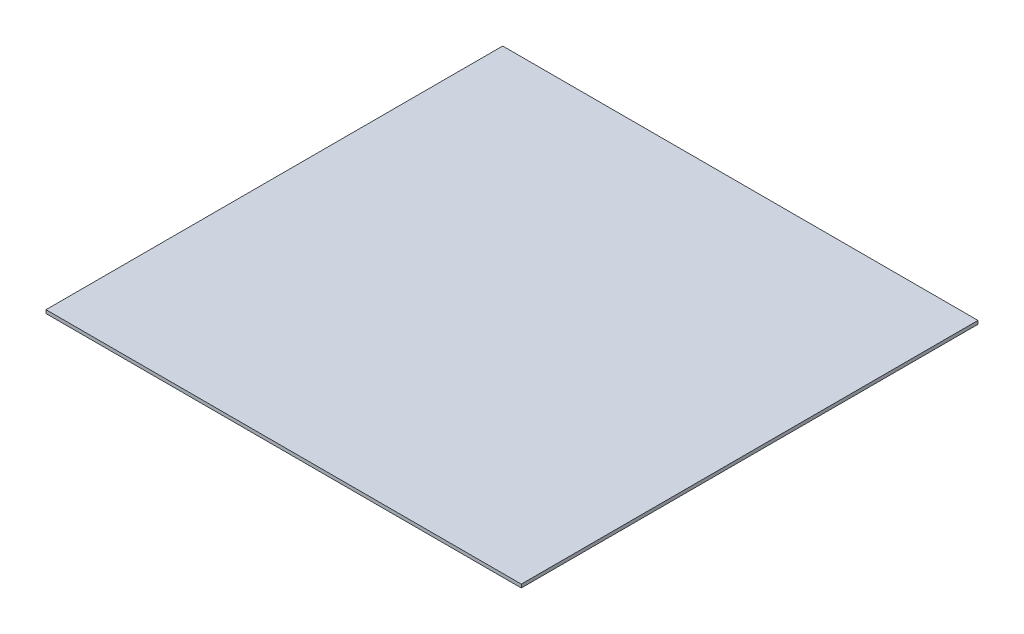
ISO-10303-21;
HEADER;
FILE_DESCRIPTION(('STEP AP214'),'2;1');
FILE_NAME('part.step','',(''),(''),'','','');
FILE_SCHEMA(('AUTOMOTIVE_DESIGN { 1 0 10303 214 1 1 1 1 }'));
ENDSEC;
DATA;
#1=APPLICATION_CONTEXT('core data for automotive mechanical design processes');
#2=APPLICATION_PROTOCOL_DEFINITION('international standard','automotive_design',2000,#1);
#3=PRODUCT_CONTEXT('',#1,'mechanical');
#4=PRODUCT('Part','Part','',(#3));
#5=PRODUCT_RELATED_PRODUCT_CATEGORY('part','',(#4));
#6=PRODUCT_DEFINITION_FORMATION('','',#4);
#7=PRODUCT_DEFINITION_CONTEXT('part definition',#1,'design');
#8=PRODUCT_DEFINITION('design','',#6,#7);
#9=PRODUCT_DEFINITION_SHAPE('','',#8);
#10=(LENGTH_UNIT() NAMED_UNIT(*) SI_UNIT(.MILLI.,.METRE.));
#11=(NAMED_UNIT(*) PLANE_ANGLE_UNIT() SI_UNIT($,.RADIAN.));
#12=(NAMED_UNIT(*) SI_UNIT($,.STERADIAN.) SOLID_ANGLE_UNIT());
#13=UNCERTAINTY_MEASURE_WITH_UNIT(LENGTH_MEASURE(1.E-05),#10,'distance_accuracy_value','');
#14=(GEOMETRIC_REPRESENTATION_CONTEXT(3) GLOBAL_UNCERTAINTY_ASSIGNED_CONTEXT((#13)) GLOBAL_UNIT_ASSIGNED_CONTEXT((#10,
#11,#12)) REPRESENTATION_CONTEXT('',''));
#15=CARTESIAN_POINT('',(0.,0.,0.));
#16=DIRECTION('',(0.,0.,1.));
#17=DIRECTION('',(1.,0.,0.));
#18=AXIS2_PLACEMENT_3D('',#15,#16,#17);
#19=CARTESIAN_POINT('',(281.,4.,-270.));
#20=DIRECTION('',(-1.,0.,0.));
#21=DIRECTION('',(0.,0.,1.));
#22=AXIS2_PLACEMENT_3D('',#19,#20,#21);
#23=PLANE('',#22);
#24=DIRECTION('',(0.,0.,-1.));
#25=VECTOR('',#24,1.);
#26=CARTESIAN_POINT('',(281.,0.,-270.));
#27=LINE('',#26,#25);
#28=CARTESIAN_POINT('',(281.,0.,270.));
#29=VERTEX_POINT('',#28);
#30=CARTESIAN_POINT('',(281.,0.,-270.));
#31=VERTEX_POINT('',#30);
#32=EDGE_CURVE('E97',#29,#31,#27,.T.);
#33=ORIENTED_EDGE('',*,*,#32,.T.);
#34=DIRECTION('',(0.,-1.,0.));
#35=VECTOR('',#34,1.);
#36=CARTESIAN_POINT('',(281.,4.,-270.));
#37=LINE('',#36,#35);
#38=CARTESIAN_POINT('',(281.,4.,-270.));
#39=VERTEX_POINT('',#38);
#40=EDGE_CURVE('E11',#39,#31,#37,.T.);
#41=ORIENTED_EDGE('',*,*,#40,.F.);
#42=DIRECTION('',(0.,0.,-1.));
#43=VECTOR('',#42,1.);
#44=CARTESIAN_POINT('',(281.,4.,-270.));
#45=LINE('',#44,#43);
#46=CARTESIAN_POINT('',(281.,4.,270.));
#47=VERTEX_POINT('',#46);
#48=EDGE_CURVE('E85',#47,#39,#45,.T.);
#49=ORIENTED_EDGE('',*,*,#48,.F.);
#50=DIRECTION('',(0.,-1.,0.));
#51=VECTOR('',#50,1.);
#52=CARTESIAN_POINT('',(281.,4.,270.));
#53=LINE('',#52,#51);
#54=EDGE_CURVE('E93',#47,#29,#53,.T.);
#55=ORIENTED_EDGE('',*,*,#54,.T.);
#56=EDGE_LOOP('',(#33,#41,#49,#55));
#57=FACE_BOUND('',#56,.T.);
#58=ADVANCED_FACE('F34',(#57),#23,.F.);
#59=CARTESIAN_POINT('',(-281.,4.,-270.));
#60=DIRECTION('',(0.,0.,1.));
#61=DIRECTION('',(1.,0.,0.));
#62=AXIS2_PLACEMENT_3D('',#59,#60,#61);
#63=PLANE('',#62);
#64=DIRECTION('',(-1.,0.,0.));
#65=VECTOR('',#64,1.);
#66=CARTESIAN_POINT('',(-281.,0.,-270.));
#67=LINE('',#66,#65);
#68=CARTESIAN_POINT('',(-281.,0.,-270.));
#69=VERTEX_POINT('',#68);
#70=EDGE_CURVE('E89',#31,#69,#67,.T.);
#71=ORIENTED_EDGE('',*,*,#70,.T.);
#72=DIRECTION('',(0.,-1.,0.));
#73=VECTOR('',#72,1.);
#74=CARTESIAN_POINT('',(-281.,4.,-270.));
#75=LINE('',#74,#73);
#76=CARTESIAN_POINT('',(-281.,4.,-270.));
#77=VERTEX_POINT('',#76);
#78=EDGE_CURVE('E42',#77,#69,#75,.T.);
#79=ORIENTED_EDGE('',*,*,#78,.F.);
#80=DIRECTION('',(-1.,0.,0.));
#81=VECTOR('',#80,1.);
#82=CARTESIAN_POINT('',(-281.,4.,-270.));
#83=LINE('',#82,#81);
#84=EDGE_CURVE('E80',#39,#77,#83,.T.);
#85=ORIENTED_EDGE('',*,*,#84,.F.);
#86=ORIENTED_EDGE('',*,*,#40,.T.);
#87=EDGE_LOOP('',(#71,#79,#85,#86));
#88=FACE_BOUND('',#87,.T.);
#89=ADVANCED_FACE('F88',(#88),#63,.F.);
#90=CARTESIAN_POINT('',(-281.,4.,-270.));
#91=DIRECTION('',(1.,0.,0.));
#92=DIRECTION('',(0.,0.,-1.));
#93=AXIS2_PLACEMENT_3D('',#90,#91,#92);
#94=PLANE('',#93);
#95=DIRECTION('',(0.,0.,1.));
#96=VECTOR('',#95,1.);
#97=CARTESIAN_POINT('',(-281.,0.,-270.));
#98=LINE('',#97,#96);
#99=CARTESIAN_POINT('',(-281.,0.,270.));
#100=VERTEX_POINT('',#99);
#101=EDGE_CURVE('E67',#69,#100,#98,.T.);
#102=ORIENTED_EDGE('',*,*,#101,.T.);
#103=DIRECTION('',(0.,-1.,0.));
#104=VECTOR('',#103,1.);
#105=CARTESIAN_POINT('',(-281.,4.,270.));
#106=LINE('',#105,#104);
#107=CARTESIAN_POINT('',(-281.,4.,270.));
#108=VERTEX_POINT('',#107);
#109=EDGE_CURVE('E90',#108,#100,#106,.T.);
#110=ORIENTED_EDGE('',*,*,#109,.F.);
#111=DIRECTION('',(0.,0.,1.));
#112=VECTOR('',#111,1.);
#113=CARTESIAN_POINT('',(-281.,4.,-270.));
#114=LINE('',#113,#112);
#115=EDGE_CURVE('E83',#77,#108,#114,.T.);
#116=ORIENTED_EDGE('',*,*,#115,.F.);
#117=ORIENTED_EDGE('',*,*,#78,.T.);
#118=EDGE_LOOP('',(#102,#110,#116,#117));
#119=FACE_BOUND('',#118,.T.);
#120=ADVANCED_FACE('F91',(#119),#94,.F.);
#121=CARTESIAN_POINT('',(-281.,4.,270.));
#122=DIRECTION('',(0.,0.,-1.));
#123=DIRECTION('',(-1.,0.,0.));
#124=AXIS2_PLACEMENT_3D('',#121,#122,#123);
#125=PLANE('',#124);
#126=DIRECTION('',(1.,0.,0.));
#127=VECTOR('',#126,1.);
#128=CARTESIAN_POINT('',(-281.,0.,270.));
#129=LINE('',#128,#127);
#130=EDGE_CURVE('E73',#100,#29,#129,.T.);
#131=ORIENTED_EDGE('',*,*,#130,.T.);
#132=ORIENTED_EDGE('',*,*,#54,.F.);
#133=DIRECTION('',(1.,0.,0.));
#134=VECTOR('',#133,1.);
#135=CARTESIAN_POINT('',(-281.,4.,270.));
#136=LINE('',#135,#134);
#137=EDGE_CURVE('E50',#108,#47,#136,.T.);
#138=ORIENTED_EDGE('',*,*,#137,.F.);
#139=ORIENTED_EDGE('',*,*,#109,.T.);
#140=EDGE_LOOP('',(#131,#132,#138,#139));
#141=FACE_BOUND('',#140,.T.);
#142=ADVANCED_FACE('F104',(#141),#125,.F.);
#143=CARTESIAN_POINT('',(0.,4.,0.));
#144=DIRECTION('',(0.,1.,0.));
#145=DIRECTION('',(0.,0.,1.));
#146=AXIS2_PLACEMENT_3D('',#143,#144,#145);
#147=PLANE('',#146);
#148=ORIENTED_EDGE('',*,*,#48,.T.);
#149=ORIENTED_EDGE('',*,*,#84,.T.);
#150=ORIENTED_EDGE('',*,*,#115,.T.);
#151=ORIENTED_EDGE('',*,*,#137,.T.);
#152=EDGE_LOOP('',(#148,#149,#150,#151));
#153=FACE_BOUND('',#152,.T.);
#154=ADVANCED_FACE('F81',(#153),#147,.T.);
#155=CARTESIAN_POINT('',(0.,0.,0.));
#156=DIRECTION('',(0.,1.,0.));
#157=DIRECTION('',(0.,0.,1.));
#158=AXIS2_PLACEMENT_3D('',#155,#156,#157);
#159=PLANE('',#158);
#160=ORIENTED_EDGE('',*,*,#32,.F.);
#161=ORIENTED_EDGE('',*,*,#130,.F.);
#162=ORIENTED_EDGE('',*,*,#101,.F.);
#163=ORIENTED_EDGE('',*,*,#70,.F.);
#164=EDGE_LOOP('',(#160,#161,#162,#163));
#165=FACE_BOUND('',#164,.T.);
#166=ADVANCED_FACE('F107',(#165),#159,.F.);
#167=CLOSED_SHELL('',(#58,#89,#120,#142,#154,#166));
#168=MANIFOLD_SOLID_BREP('B2',#167);
#169=ADVANCED_BREP_SHAPE_REPRESENTATION('',(#18,#168),#14);
#170=SHAPE_DEFINITION_REPRESENTATION(#9,#169);
ENDSEC;
END-ISO-10303-21;
